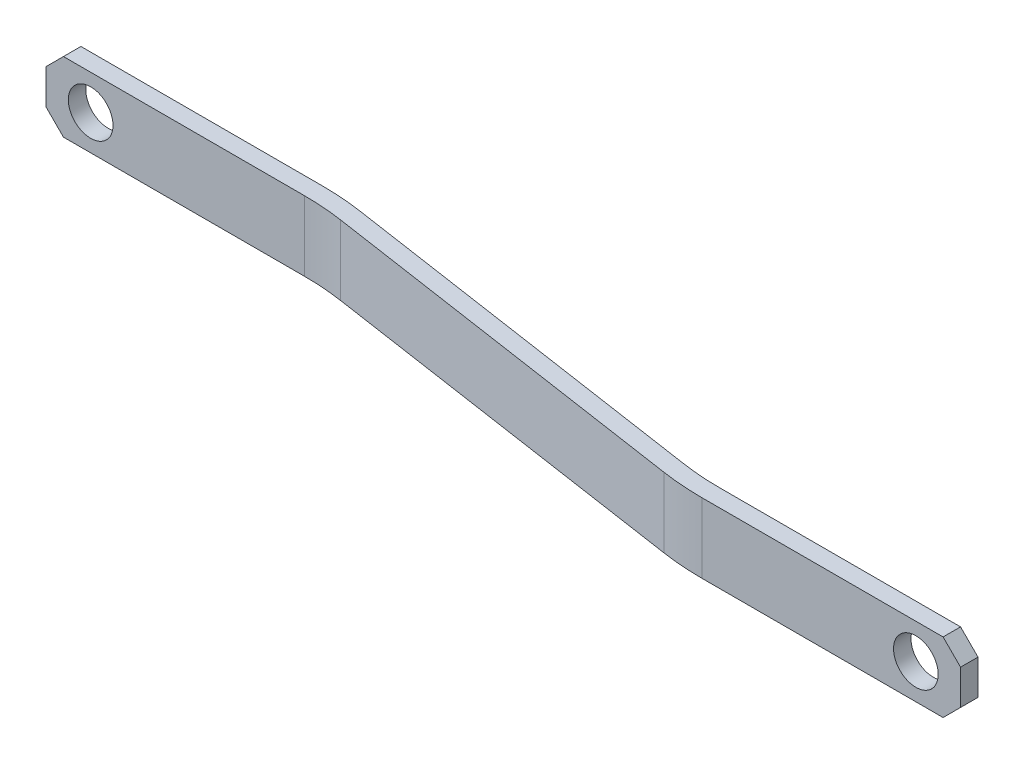
ISO-10303-21;
HEADER;
FILE_DESCRIPTION(('STEP AP214'),'2;1');
FILE_NAME('part.step','',(''),(''),'','','');
FILE_SCHEMA(('AUTOMOTIVE_DESIGN { 1 0 10303 214 1 1 1 1 }'));
ENDSEC;
DATA;
#1=APPLICATION_CONTEXT('core data for automotive mechanical design processes');
#2=APPLICATION_PROTOCOL_DEFINITION('international standard','automotive_design',2000,#1);
#3=PRODUCT_CONTEXT('',#1,'mechanical');
#4=PRODUCT('Part','Part','',(#3));
#5=PRODUCT_RELATED_PRODUCT_CATEGORY('part','',(#4));
#6=PRODUCT_DEFINITION_FORMATION('','',#4);
#7=PRODUCT_DEFINITION_CONTEXT('part definition',#1,'design');
#8=PRODUCT_DEFINITION('design','',#6,#7);
#9=PRODUCT_DEFINITION_SHAPE('','',#8);
#10=(LENGTH_UNIT() NAMED_UNIT(*) SI_UNIT(.MILLI.,.METRE.));
#11=(NAMED_UNIT(*) PLANE_ANGLE_UNIT() SI_UNIT($,.RADIAN.));
#12=(NAMED_UNIT(*) SI_UNIT($,.STERADIAN.) SOLID_ANGLE_UNIT());
#13=UNCERTAINTY_MEASURE_WITH_UNIT(LENGTH_MEASURE(1.E-05),#10,'distance_accuracy_value','');
#14=(GEOMETRIC_REPRESENTATION_CONTEXT(3) GLOBAL_UNCERTAINTY_ASSIGNED_CONTEXT((#13)) GLOBAL_UNIT_ASSIGNED_CONTEXT((#10,
#11,#12)) REPRESENTATION_CONTEXT('',''));
#15=CARTESIAN_POINT('',(0.,0.,0.));
#16=DIRECTION('',(0.,0.,1.));
#17=DIRECTION('',(1.,0.,0.));
#18=AXIS2_PLACEMENT_3D('',#15,#16,#17);
#19=CARTESIAN_POINT('',(47.0227665510806,-38.1,50.8));
#20=DIRECTION('',(0.,1.,0.));
#21=DIRECTION('',(-1.,0.,0.));
#22=AXIS2_PLACEMENT_3D('',#19,#20,#21);
#23=CYLINDRICAL_SURFACE('',#22,50.8);
#24=DIRECTION('',(0.,1.,0.));
#25=VECTOR('',#24,1.);
#26=CARTESIAN_POINT('',(54.5356969778409,-38.1,0.558623860381184));
#27=LINE('',#26,#25);
#28=CARTESIAN_POINT('',(54.5356969778409,0.,0.558623860381192));
#29=VERTEX_POINT('',#28);
#30=CARTESIAN_POINT('',(54.5356969778409,12.7,0.558623860381191));
#31=VERTEX_POINT('',#30);
#32=EDGE_CURVE('E271',#29,#31,#27,.T.);
#33=ORIENTED_EDGE('',*,*,#32,.F.);
#34=CARTESIAN_POINT('',(47.0227665510806,0.,50.8));
#35=DIRECTION('',(0.,1.,0.));
#36=DIRECTION('',(0.,0.,1.));
#37=AXIS2_PLACEMENT_3D('',#34,#35,#36);
#38=CIRCLE('',#37,50.8);
#39=CARTESIAN_POINT('',(47.0227665510806,0.,0.));
#40=VERTEX_POINT('',#39);
#41=EDGE_CURVE('E269',#29,#40,#38,.T.);
#42=ORIENTED_EDGE('',*,*,#41,.T.);
#43=DIRECTION('',(0.,1.,0.));
#44=VECTOR('',#43,1.);
#45=CARTESIAN_POINT('',(47.0227665510806,-38.1,0.));
#46=LINE('',#45,#44);
#47=CARTESIAN_POINT('',(47.0227665510806,12.7,0.));
#48=VERTEX_POINT('',#47);
#49=EDGE_CURVE('E190',#40,#48,#46,.T.);
#50=ORIENTED_EDGE('',*,*,#49,.T.);
#51=CARTESIAN_POINT('',(47.0227665510806,12.7,50.8));
#52=DIRECTION('',(0.,1.,0.));
#53=DIRECTION('',(1.,0.,0.));
#54=AXIS2_PLACEMENT_3D('',#51,#52,#53);
#55=CIRCLE('',#54,50.8);
#56=EDGE_CURVE('E236',#31,#48,#55,.T.);
#57=ORIENTED_EDGE('',*,*,#56,.F.);
#58=EDGE_LOOP('',(#33,#42,#50,#57));
#59=FACE_BOUND('',#58,.T.);
#60=ADVANCED_FACE('F47',(#59),#23,.T.);
#61=CARTESIAN_POINT('',(130.777233448919,-38.1,11.43));
#62=DIRECTION('',(0.,0.,-1.));
#63=DIRECTION('',(-1.,0.,0.));
#64=AXIS2_PLACEMENT_3D('',#61,#62,#63);
#65=PLANE('',#64);
#66=CARTESIAN_POINT('',(169.672,6.34999999999999,11.43));
#67=DIRECTION('',(0.,0.,1.));
#68=DIRECTION('',(1.,0.,0.));
#69=AXIS2_PLACEMENT_3D('',#66,#67,#68);
#70=CIRCLE('',#69,4.06399999999999);
#71=CARTESIAN_POINT('',(173.736,6.34999999999999,11.43));
#72=VERTEX_POINT('',#71);
#73=EDGE_CURVE('E307',#72,#72,#70,.T.);
#74=ORIENTED_EDGE('',*,*,#73,.T.);
#75=EDGE_LOOP('',(#74));
#76=FACE_BOUND('',#75,.T.);
#77=DIRECTION('',(-1.,0.,0.));
#78=VECTOR('',#77,1.);
#79=CARTESIAN_POINT('',(130.777233448919,12.7,11.43));
#80=LINE('',#79,#78);
#81=CARTESIAN_POINT('',(174.625,12.7,11.43));
#82=VERTEX_POINT('',#81);
#83=CARTESIAN_POINT('',(130.777233448919,12.7,11.43));
#84=VERTEX_POINT('',#83);
#85=EDGE_CURVE('E184',#82,#84,#80,.T.);
#86=ORIENTED_EDGE('',*,*,#85,.F.);
#87=DIRECTION('',(0.707106781186553,-0.707106781186542,0.));
#88=VECTOR('',#87,1.);
#89=CARTESIAN_POINT('',(178.101116724459,9.22388327554063,11.43));
#90=LINE('',#89,#88);
#91=CARTESIAN_POINT('',(177.8,9.52499999999996,11.43));
#92=VERTEX_POINT('',#91);
#93=EDGE_CURVE('E200',#82,#92,#90,.T.);
#94=ORIENTED_EDGE('',*,*,#93,.T.);
#95=DIRECTION('',(0.,1.,0.));
#96=VECTOR('',#95,1.);
#97=CARTESIAN_POINT('',(177.8,-38.1,11.43));
#98=LINE('',#97,#96);
#99=CARTESIAN_POINT('',(177.8,3.17500000000003,11.43));
#100=VERTEX_POINT('',#99);
#101=EDGE_CURVE('E279',#100,#92,#98,.T.);
#102=ORIENTED_EDGE('',*,*,#101,.F.);
#103=DIRECTION('',(-0.707106781186555,-0.70710678118654,0.));
#104=VECTOR('',#103,1.);
#105=CARTESIAN_POINT('',(133.651116724459,-40.9738832755398,11.43));
#106=LINE('',#105,#104);
#107=CARTESIAN_POINT('',(174.625,0.,11.43));
#108=VERTEX_POINT('',#107);
#109=EDGE_CURVE('E192',#100,#108,#106,.T.);
#110=ORIENTED_EDGE('',*,*,#109,.T.);
#111=DIRECTION('',(-1.,0.,0.));
#112=VECTOR('',#111,1.);
#113=CARTESIAN_POINT('',(0.,0.,11.43));
#114=LINE('',#113,#112);
#115=CARTESIAN_POINT('',(130.777233448919,0.,11.43));
#116=VERTEX_POINT('',#115);
#117=EDGE_CURVE('E258',#108,#116,#114,.T.);
#118=ORIENTED_EDGE('',*,*,#117,.T.);
#119=DIRECTION('',(0.,1.,0.));
#120=VECTOR('',#119,1.);
#121=CARTESIAN_POINT('',(130.777233448919,-38.1,11.43));
#122=LINE('',#121,#120);
#123=EDGE_CURVE('E282',#116,#84,#122,.T.);
#124=ORIENTED_EDGE('',*,*,#123,.T.);
#125=EDGE_LOOP('',(#86,#94,#102,#110,#118,#124));
#126=FACE_BOUND('',#125,.T.);
#127=ADVANCED_FACE('F331',(#76,#126),#65,.T.);
#128=CARTESIAN_POINT('',(130.777233448919,-38.1,-36.195));
#129=DIRECTION('',(0.,1.,0.));
#130=DIRECTION('',(-1.,0.,0.));
#131=AXIS2_PLACEMENT_3D('',#128,#129,#130);
#132=CYLINDRICAL_SURFACE('',#131,47.625);
#133=ORIENTED_EDGE('',*,*,#123,.F.);
#134=CARTESIAN_POINT('',(130.777233448919,0.,-36.195));
#135=DIRECTION('',(0.,1.,0.));
#136=DIRECTION('',(0.,0.,1.));
#137=AXIS2_PLACEMENT_3D('',#134,#135,#136);
#138=CIRCLE('',#137,47.625);
#139=CARTESIAN_POINT('',(123.733861173832,0.,10.9062901308926));
#140=VERTEX_POINT('',#139);
#141=EDGE_CURVE('E255',#116,#140,#138,.F.);
#142=ORIENTED_EDGE('',*,*,#141,.T.);
#143=DIRECTION('',(0.,1.,0.));
#144=VECTOR('',#143,1.);
#145=CARTESIAN_POINT('',(123.733861173832,-38.1,10.9062901308926));
#146=LINE('',#145,#144);
#147=CARTESIAN_POINT('',(123.733861173832,12.7,10.9062901308926));
#148=VERTEX_POINT('',#147);
#149=EDGE_CURVE('E285',#140,#148,#146,.T.);
#150=ORIENTED_EDGE('',*,*,#149,.T.);
#151=CARTESIAN_POINT('',(130.777233448919,12.7,-36.195));
#152=DIRECTION('',(0.,-1.,0.));
#153=DIRECTION('',(-1.,0.,0.));
#154=AXIS2_PLACEMENT_3D('',#151,#152,#153);
#155=CIRCLE('',#154,47.625);
#156=EDGE_CURVE('E293',#84,#148,#155,.T.);
#157=ORIENTED_EDGE('',*,*,#156,.F.);
#158=EDGE_LOOP('',(#133,#142,#150,#157));
#159=FACE_BOUND('',#158,.T.);
#160=ADVANCED_FACE('F337',(#159),#132,.F.);
#161=CARTESIAN_POINT('',(54.5356969778409,-38.1,0.558623860381191));
#162=DIRECTION('',(0.147892331235438,0.,-0.989003467315331));
#163=DIRECTION('',(-0.989003467315331,0.,-0.147892331235438));
#164=AXIS2_PLACEMENT_3D('',#161,#162,#163);
#165=PLANE('',#164);
#166=ORIENTED_EDGE('',*,*,#149,.F.);
#167=DIRECTION('',(-0.989003467315331,0.,-0.147892331235438));
#168=VECTOR('',#167,1.);
#169=CARTESIAN_POINT('',(3.24732013973059,0.,-7.11087161313806));
#170=LINE('',#169,#168);
#171=EDGE_CURVE('E247',#140,#29,#170,.T.);
#172=ORIENTED_EDGE('',*,*,#171,.T.);
#173=ORIENTED_EDGE('',*,*,#32,.T.);
#174=DIRECTION('',(-0.989003467315331,0.,-0.147892331235438));
#175=VECTOR('',#174,1.);
#176=CARTESIAN_POINT('',(54.5356969778409,12.7,0.558623860381191));
#177=LINE('',#176,#175);
#178=EDGE_CURVE('E291',#148,#31,#177,.T.);
#179=ORIENTED_EDGE('',*,*,#178,.F.);
#180=EDGE_LOOP('',(#166,#172,#173,#179));
#181=FACE_BOUND('',#180,.T.);
#182=ADVANCED_FACE('F345',(#181),#165,.T.);
#183=CARTESIAN_POINT('',(0.,0.,0.));
#184=DIRECTION('',(0.,0.,-1.));
#185=DIRECTION('',(-1.,0.,0.));
#186=AXIS2_PLACEMENT_3D('',#183,#184,#185);
#187=PLANE('',#186);
#188=CARTESIAN_POINT('',(8.128,6.35,0.));
#189=DIRECTION('',(0.,0.,1.));
#190=DIRECTION('',(1.,0.,0.));
#191=AXIS2_PLACEMENT_3D('',#188,#189,#190);
#192=CIRCLE('',#191,4.064);
#193=CARTESIAN_POINT('',(12.192,6.35,0.));
#194=VERTEX_POINT('',#193);
#195=EDGE_CURVE('E300',#194,#194,#192,.T.);
#196=ORIENTED_EDGE('',*,*,#195,.T.);
#197=EDGE_LOOP('',(#196));
#198=FACE_BOUND('',#197,.T.);
#199=DIRECTION('',(0.,1.,0.));
#200=VECTOR('',#199,1.);
#201=CARTESIAN_POINT('',(0.,0.,0.));
#202=LINE('',#201,#200);
#203=CARTESIAN_POINT('',(0.,3.17500000000002,0.));
#204=VERTEX_POINT('',#203);
#205=CARTESIAN_POINT('',(0.,9.52499999999998,0.));
#206=VERTEX_POINT('',#205);
#207=EDGE_CURVE('E244',#204,#206,#202,.T.);
#208=ORIENTED_EDGE('',*,*,#207,.T.);
#209=DIRECTION('',(0.707106781186556,0.707106781186539,0.));
#210=VECTOR('',#209,1.);
#211=CARTESIAN_POINT('',(-4.76249999999999,4.7625000000001,0.));
#212=LINE('',#211,#210);
#213=CARTESIAN_POINT('',(3.17500000000009,12.7,0.));
#214=VERTEX_POINT('',#213);
#215=EDGE_CURVE('E219',#206,#214,#212,.T.);
#216=ORIENTED_EDGE('',*,*,#215,.T.);
#217=DIRECTION('',(-1.,0.,0.));
#218=VECTOR('',#217,1.);
#219=CARTESIAN_POINT('',(177.8,12.7,0.));
#220=LINE('',#219,#218);
#221=EDGE_CURVE('E242',#48,#214,#220,.T.);
#222=ORIENTED_EDGE('',*,*,#221,.F.);
#223=ORIENTED_EDGE('',*,*,#49,.F.);
#224=DIRECTION('',(1.,0.,0.));
#225=VECTOR('',#224,1.);
#226=CARTESIAN_POINT('',(0.,0.,0.));
#227=LINE('',#226,#225);
#228=CARTESIAN_POINT('',(3.17500000000005,0.,0.));
#229=VERTEX_POINT('',#228);
#230=EDGE_CURVE('E174',#229,#40,#227,.T.);
#231=ORIENTED_EDGE('',*,*,#230,.F.);
#232=DIRECTION('',(-0.707106781186551,0.707106781186544,0.));
#233=VECTOR('',#232,1.);
#234=CARTESIAN_POINT('',(1.58750000000001,1.58750000000003,0.));
#235=LINE('',#234,#233);
#236=EDGE_CURVE('E217',#229,#204,#235,.T.);
#237=ORIENTED_EDGE('',*,*,#236,.T.);
#238=EDGE_LOOP('',(#208,#216,#222,#223,#231,#237));
#239=FACE_BOUND('',#238,.T.);
#240=ADVANCED_FACE('F240',(#198,#239),#187,.T.);
#241=CARTESIAN_POINT('',(0.,0.,14.605));
#242=DIRECTION('',(-1.,0.,0.));
#243=DIRECTION('',(0.,0.,1.));
#244=AXIS2_PLACEMENT_3D('',#241,#242,#243);
#245=PLANE('',#244);
#246=DIRECTION('',(0.,1.,0.));
#247=VECTOR('',#246,1.);
#248=CARTESIAN_POINT('',(0.,-38.1,3.175));
#249=LINE('',#248,#247);
#250=CARTESIAN_POINT('',(0.,3.17500000000003,3.175));
#251=VERTEX_POINT('',#250);
#252=CARTESIAN_POINT('',(0.,9.52499999999998,3.175));
#253=VERTEX_POINT('',#252);
#254=EDGE_CURVE('E225',#251,#253,#249,.T.);
#255=ORIENTED_EDGE('',*,*,#254,.T.);
#256=DIRECTION('',(0.,0.,-1.));
#257=VECTOR('',#256,1.);
#258=CARTESIAN_POINT('',(0.,9.52499999999998,0.));
#259=LINE('',#258,#257);
#260=EDGE_CURVE('E214',#253,#206,#259,.T.);
#261=ORIENTED_EDGE('',*,*,#260,.T.);
#262=ORIENTED_EDGE('',*,*,#207,.F.);
#263=DIRECTION('',(0.,0.,1.));
#264=VECTOR('',#263,1.);
#265=CARTESIAN_POINT('',(0.,3.17500000000002,3.175));
#266=LINE('',#265,#264);
#267=EDGE_CURVE('E212',#204,#251,#266,.T.);
#268=ORIENTED_EDGE('',*,*,#267,.T.);
#269=EDGE_LOOP('',(#255,#261,#262,#268));
#270=FACE_BOUND('',#269,.T.);
#271=ADVANCED_FACE('F231',(#270),#245,.T.);
#272=CARTESIAN_POINT('',(0.,0.,14.605));
#273=DIRECTION('',(0.,1.,0.));
#274=DIRECTION('',(0.,0.,1.));
#275=AXIS2_PLACEMENT_3D('',#272,#273,#274);
#276=PLANE('',#275);
#277=DIRECTION('',(1.,0.,0.));
#278=VECTOR('',#277,1.);
#279=CARTESIAN_POINT('',(0.,0.,3.175));
#280=LINE('',#279,#278);
#281=CARTESIAN_POINT('',(3.17500000000005,0.,3.175));
#282=VERTEX_POINT('',#281);
#283=CARTESIAN_POINT('',(47.0227665510805,0.,3.17499999999999));
#284=VERTEX_POINT('',#283);
#285=EDGE_CURVE('E266',#282,#284,#280,.T.);
#286=ORIENTED_EDGE('',*,*,#285,.F.);
#287=DIRECTION('',(0.,0.,-1.));
#288=VECTOR('',#287,1.);
#289=CARTESIAN_POINT('',(3.17500000000005,0.,0.));
#290=LINE('',#289,#288);
#291=EDGE_CURVE('E11',#282,#229,#290,.T.);
#292=ORIENTED_EDGE('',*,*,#291,.T.);
#293=ORIENTED_EDGE('',*,*,#230,.T.);
#294=ORIENTED_EDGE('',*,*,#41,.F.);
#295=ORIENTED_EDGE('',*,*,#171,.F.);
#296=ORIENTED_EDGE('',*,*,#141,.F.);
#297=ORIENTED_EDGE('',*,*,#117,.F.);
#298=DIRECTION('',(0.,0.,1.));
#299=VECTOR('',#298,1.);
#300=CARTESIAN_POINT('',(174.625,0.,14.605));
#301=LINE('',#300,#299);
#302=CARTESIAN_POINT('',(174.625,0.,14.605));
#303=VERTEX_POINT('',#302);
#304=EDGE_CURVE('E210',#108,#303,#301,.T.);
#305=ORIENTED_EDGE('',*,*,#304,.T.);
#306=DIRECTION('',(1.,0.,0.));
#307=VECTOR('',#306,1.);
#308=CARTESIAN_POINT('',(0.,0.,14.605));
#309=LINE('',#308,#307);
#310=CARTESIAN_POINT('',(130.777233448919,0.,14.605));
#311=VERTEX_POINT('',#310);
#312=EDGE_CURVE('E195',#311,#303,#309,.T.);
#313=ORIENTED_EDGE('',*,*,#312,.F.);
#314=CARTESIAN_POINT('',(130.777233448919,0.,-36.195));
#315=DIRECTION('',(0.,1.,0.));
#316=DIRECTION('',(0.,0.,1.));
#317=AXIS2_PLACEMENT_3D('',#314,#315,#316);
#318=CIRCLE('',#317,50.8);
#319=CARTESIAN_POINT('',(123.264303022159,0.,14.0463761396188));
#320=VERTEX_POINT('',#319);
#321=EDGE_CURVE('E188',#320,#311,#318,.T.);
#322=ORIENTED_EDGE('',*,*,#321,.F.);
#323=DIRECTION('',(0.989003467315331,0.,0.147892331235439));
#324=VECTOR('',#323,1.);
#325=CARTESIAN_POINT('',(2.77776198805809,0.,-3.97078560441192));
#326=LINE('',#325,#324);
#327=CARTESIAN_POINT('',(54.0661388261683,0.,3.69870986910734));
#328=VERTEX_POINT('',#327);
#329=EDGE_CURVE('E260',#328,#320,#326,.T.);
#330=ORIENTED_EDGE('',*,*,#329,.F.);
#331=CARTESIAN_POINT('',(47.0227665510805,0.,50.8));
#332=DIRECTION('',(0.,1.,0.));
#333=DIRECTION('',(0.,0.,1.));
#334=AXIS2_PLACEMENT_3D('',#331,#332,#333);
#335=CIRCLE('',#334,47.625);
#336=EDGE_CURVE('E263',#284,#328,#335,.F.);
#337=ORIENTED_EDGE('',*,*,#336,.F.);
#338=EDGE_LOOP('',(#286,#292,#293,#294,#295,#296,#297,#305,#313,#322,#330,#337));
#339=FACE_BOUND('',#338,.T.);
#340=ADVANCED_FACE('F374',(#339),#276,.F.);
#341=CARTESIAN_POINT('',(177.8,12.7,14.605));
#342=DIRECTION('',(1.,0.,0.));
#343=DIRECTION('',(0.,0.,-1.));
#344=AXIS2_PLACEMENT_3D('',#341,#342,#343);
#345=PLANE('',#344);
#346=ORIENTED_EDGE('',*,*,#101,.T.);
#347=DIRECTION('',(0.,0.,1.));
#348=VECTOR('',#347,1.);
#349=CARTESIAN_POINT('',(177.8,9.52499999999996,14.605));
#350=LINE('',#349,#348);
#351=CARTESIAN_POINT('',(177.8,9.52499999999996,14.605));
#352=VERTEX_POINT('',#351);
#353=EDGE_CURVE('E205',#92,#352,#350,.T.);
#354=ORIENTED_EDGE('',*,*,#353,.T.);
#355=DIRECTION('',(0.,-1.,0.));
#356=VECTOR('',#355,1.);
#357=CARTESIAN_POINT('',(177.8,12.7,14.605));
#358=LINE('',#357,#356);
#359=CARTESIAN_POINT('',(177.8,3.17500000000002,14.605));
#360=VERTEX_POINT('',#359);
#361=EDGE_CURVE('E173',#352,#360,#358,.T.);
#362=ORIENTED_EDGE('',*,*,#361,.T.);
#363=DIRECTION('',(0.,0.,-1.));
#364=VECTOR('',#363,1.);
#365=CARTESIAN_POINT('',(177.8,3.17500000000002,11.43));
#366=LINE('',#365,#364);
#367=EDGE_CURVE('E202',#360,#100,#366,.T.);
#368=ORIENTED_EDGE('',*,*,#367,.T.);
#369=EDGE_LOOP('',(#346,#354,#362,#368));
#370=FACE_BOUND('',#369,.T.);
#371=ADVANCED_FACE('F326',(#370),#345,.T.);
#372=CARTESIAN_POINT('',(177.8,12.7,14.605));
#373=DIRECTION('',(0.,-1.,0.));
#374=DIRECTION('',(1.,0.,0.));
#375=AXIS2_PLACEMENT_3D('',#372,#373,#374);
#376=PLANE('',#375);
#377=ORIENTED_EDGE('',*,*,#221,.T.);
#378=DIRECTION('',(0.,0.,1.));
#379=VECTOR('',#378,1.);
#380=CARTESIAN_POINT('',(3.17500000000009,12.7,3.175));
#381=LINE('',#380,#379);
#382=CARTESIAN_POINT('',(3.17500000000009,12.7,3.175));
#383=VERTEX_POINT('',#382);
#384=EDGE_CURVE('E70',#214,#383,#381,.T.);
#385=ORIENTED_EDGE('',*,*,#384,.T.);
#386=DIRECTION('',(1.,0.,0.));
#387=VECTOR('',#386,1.);
#388=CARTESIAN_POINT('',(0.,12.7,3.175));
#389=LINE('',#388,#387);
#390=CARTESIAN_POINT('',(47.0227665510805,12.7,3.17499999999999));
#391=VERTEX_POINT('',#390);
#392=EDGE_CURVE('E227',#383,#391,#389,.T.);
#393=ORIENTED_EDGE('',*,*,#392,.T.);
#394=CARTESIAN_POINT('',(47.0227665510805,12.7,50.8));
#395=DIRECTION('',(0.,-1.,0.));
#396=DIRECTION('',(1.,0.,0.));
#397=AXIS2_PLACEMENT_3D('',#394,#395,#396);
#398=CIRCLE('',#397,47.625);
#399=CARTESIAN_POINT('',(54.0661388261683,12.7,3.69870986910734));
#400=VERTEX_POINT('',#399);
#401=EDGE_CURVE('E297',#391,#400,#398,.T.);
#402=ORIENTED_EDGE('',*,*,#401,.T.);
#403=DIRECTION('',(0.989003467315331,0.,0.147892331235439));
#404=VECTOR('',#403,1.);
#405=CARTESIAN_POINT('',(54.0661388261683,12.7,3.69870986910734));
#406=LINE('',#405,#404);
#407=CARTESIAN_POINT('',(123.264303022159,12.7,14.0463761396188));
#408=VERTEX_POINT('',#407);
#409=EDGE_CURVE('E180',#400,#408,#406,.T.);
#410=ORIENTED_EDGE('',*,*,#409,.T.);
#411=CARTESIAN_POINT('',(130.777233448919,12.7,-36.195));
#412=DIRECTION('',(0.,1.,0.));
#413=DIRECTION('',(-1.,0.,0.));
#414=AXIS2_PLACEMENT_3D('',#411,#412,#413);
#415=CIRCLE('',#414,50.8);
#416=CARTESIAN_POINT('',(130.777233448919,12.7,14.605));
#417=VERTEX_POINT('',#416);
#418=EDGE_CURVE('E177',#408,#417,#415,.T.);
#419=ORIENTED_EDGE('',*,*,#418,.T.);
#420=DIRECTION('',(-1.,0.,0.));
#421=VECTOR('',#420,1.);
#422=CARTESIAN_POINT('',(177.8,12.7,14.605));
#423=LINE('',#422,#421);
#424=CARTESIAN_POINT('',(174.625,12.7,14.605));
#425=VERTEX_POINT('',#424);
#426=EDGE_CURVE('E161',#425,#417,#423,.T.);
#427=ORIENTED_EDGE('',*,*,#426,.F.);
#428=DIRECTION('',(0.,0.,-1.));
#429=VECTOR('',#428,1.);
#430=CARTESIAN_POINT('',(174.625,12.7,11.43));
#431=LINE('',#430,#429);
#432=EDGE_CURVE('E189',#425,#82,#431,.T.);
#433=ORIENTED_EDGE('',*,*,#432,.T.);
#434=ORIENTED_EDGE('',*,*,#85,.T.);
#435=ORIENTED_EDGE('',*,*,#156,.T.);
#436=ORIENTED_EDGE('',*,*,#178,.T.);
#437=ORIENTED_EDGE('',*,*,#56,.T.);
#438=EDGE_LOOP('',(#377,#385,#393,#402,#410,#419,#427,#433,#434,#435,#436,#437));
#439=FACE_BOUND('',#438,.T.);
#440=ADVANCED_FACE('F178',(#439),#376,.F.);
#441=CARTESIAN_POINT('',(0.,0.,14.605));
#442=DIRECTION('',(0.,0.,-1.));
#443=DIRECTION('',(-1.,0.,0.));
#444=AXIS2_PLACEMENT_3D('',#441,#442,#443);
#445=PLANE('',#444);
#446=CARTESIAN_POINT('',(169.672,6.34999999999999,14.605));
#447=DIRECTION('',(0.,0.,1.));
#448=DIRECTION('',(1.,0.,0.));
#449=AXIS2_PLACEMENT_3D('',#446,#447,#448);
#450=CIRCLE('',#449,4.06399999999999);
#451=CARTESIAN_POINT('',(173.736,6.34999999999999,14.605));
#452=VERTEX_POINT('',#451);
#453=EDGE_CURVE('E304',#452,#452,#450,.T.);
#454=ORIENTED_EDGE('',*,*,#453,.F.);
#455=EDGE_LOOP('',(#454));
#456=FACE_BOUND('',#455,.T.);
#457=ORIENTED_EDGE('',*,*,#361,.F.);
#458=DIRECTION('',(-0.707106781186553,0.707106781186542,0.));
#459=VECTOR('',#458,1.);
#460=CARTESIAN_POINT('',(174.625,12.7,14.605));
#461=LINE('',#460,#459);
#462=EDGE_CURVE('E170',#352,#425,#461,.T.);
#463=ORIENTED_EDGE('',*,*,#462,.T.);
#464=ORIENTED_EDGE('',*,*,#426,.T.);
#465=DIRECTION('',(0.,1.,0.));
#466=VECTOR('',#465,1.);
#467=CARTESIAN_POINT('',(130.777233448919,-38.1,14.605));
#468=LINE('',#467,#466);
#469=EDGE_CURVE('E167',#311,#417,#468,.T.);
#470=ORIENTED_EDGE('',*,*,#469,.F.);
#471=ORIENTED_EDGE('',*,*,#312,.T.);
#472=DIRECTION('',(0.707106781186555,0.70710678118654,0.));
#473=VECTOR('',#472,1.);
#474=CARTESIAN_POINT('',(177.8,3.17500000000002,14.605));
#475=LINE('',#474,#473);
#476=EDGE_CURVE('E207',#303,#360,#475,.T.);
#477=ORIENTED_EDGE('',*,*,#476,.T.);
#478=EDGE_LOOP('',(#457,#463,#464,#470,#471,#477));
#479=FACE_BOUND('',#478,.T.);
#480=ADVANCED_FACE('F164',(#456,#479),#445,.F.);
#481=CARTESIAN_POINT('',(54.0661388261683,-38.1,3.69870986910734));
#482=DIRECTION('',(-0.147892331235439,0.,0.989003467315331));
#483=DIRECTION('',(0.989003467315331,0.,0.147892331235439));
#484=AXIS2_PLACEMENT_3D('',#481,#482,#483);
#485=PLANE('',#484);
#486=DIRECTION('',(0.,1.,0.));
#487=VECTOR('',#486,1.);
#488=CARTESIAN_POINT('',(54.0661388261683,-38.1,3.69870986910734));
#489=LINE('',#488,#487);
#490=EDGE_CURVE('E274',#328,#400,#489,.T.);
#491=ORIENTED_EDGE('',*,*,#490,.F.);
#492=ORIENTED_EDGE('',*,*,#329,.T.);
#493=DIRECTION('',(0.,1.,0.));
#494=VECTOR('',#493,1.);
#495=CARTESIAN_POINT('',(123.264303022159,-38.1,14.0463761396188));
#496=LINE('',#495,#494);
#497=EDGE_CURVE('E277',#320,#408,#496,.T.);
#498=ORIENTED_EDGE('',*,*,#497,.T.);
#499=ORIENTED_EDGE('',*,*,#409,.F.);
#500=EDGE_LOOP('',(#491,#492,#498,#499));
#501=FACE_BOUND('',#500,.T.);
#502=ADVANCED_FACE('F317',(#501),#485,.T.);
#503=CARTESIAN_POINT('',(47.0227665510805,-38.1,50.8));
#504=DIRECTION('',(0.,1.,0.));
#505=DIRECTION('',(-1.,0.,0.));
#506=AXIS2_PLACEMENT_3D('',#503,#504,#505);
#507=CYLINDRICAL_SURFACE('',#506,47.625);
#508=DIRECTION('',(0.,1.,0.));
#509=VECTOR('',#508,1.);
#510=CARTESIAN_POINT('',(47.0227665510805,-38.1,3.17499999999999));
#511=LINE('',#510,#509);
#512=EDGE_CURVE('E235',#284,#391,#511,.T.);
#513=ORIENTED_EDGE('',*,*,#512,.F.);
#514=ORIENTED_EDGE('',*,*,#336,.T.);
#515=ORIENTED_EDGE('',*,*,#490,.T.);
#516=ORIENTED_EDGE('',*,*,#401,.F.);
#517=EDGE_LOOP('',(#513,#514,#515,#516));
#518=FACE_BOUND('',#517,.T.);
#519=ADVANCED_FACE('F323',(#518),#507,.F.);
#520=CARTESIAN_POINT('',(0.,-38.1,3.175));
#521=DIRECTION('',(0.,0.,1.));
#522=DIRECTION('',(1.,0.,0.));
#523=AXIS2_PLACEMENT_3D('',#520,#521,#522);
#524=PLANE('',#523);
#525=CARTESIAN_POINT('',(8.128,6.35,3.175));
#526=DIRECTION('',(0.,0.,1.));
#527=DIRECTION('',(1.,0.,0.));
#528=AXIS2_PLACEMENT_3D('',#525,#526,#527);
#529=CIRCLE('',#528,4.064);
#530=CARTESIAN_POINT('',(12.192,6.35,3.175));
#531=VERTEX_POINT('',#530);
#532=EDGE_CURVE('E301',#531,#531,#529,.T.);
#533=ORIENTED_EDGE('',*,*,#532,.F.);
#534=EDGE_LOOP('',(#533));
#535=FACE_BOUND('',#534,.T.);
#536=ORIENTED_EDGE('',*,*,#392,.F.);
#537=DIRECTION('',(-0.707106781186556,-0.707106781186539,0.));
#538=VECTOR('',#537,1.);
#539=CARTESIAN_POINT('',(-23.8125,-14.2874999999995,3.175));
#540=LINE('',#539,#538);
#541=EDGE_CURVE('E55',#383,#253,#540,.T.);
#542=ORIENTED_EDGE('',*,*,#541,.T.);
#543=ORIENTED_EDGE('',*,*,#254,.F.);
#544=DIRECTION('',(0.707106781186551,-0.707106781186544,0.));
#545=VECTOR('',#544,1.);
#546=CARTESIAN_POINT('',(20.6375,-17.4624999999998,3.175));
#547=LINE('',#546,#545);
#548=EDGE_CURVE('E62',#251,#282,#547,.T.);
#549=ORIENTED_EDGE('',*,*,#548,.T.);
#550=ORIENTED_EDGE('',*,*,#285,.T.);
#551=ORIENTED_EDGE('',*,*,#512,.T.);
#552=EDGE_LOOP('',(#536,#542,#543,#549,#550,#551));
#553=FACE_BOUND('',#552,.T.);
#554=ADVANCED_FACE('F224',(#535,#553),#524,.T.);
#555=CARTESIAN_POINT('',(130.777233448919,-38.1,-36.195));
#556=DIRECTION('',(0.,1.,0.));
#557=DIRECTION('',(-1.,0.,0.));
#558=AXIS2_PLACEMENT_3D('',#555,#556,#557);
#559=CYLINDRICAL_SURFACE('',#558,50.8);
#560=ORIENTED_EDGE('',*,*,#497,.F.);
#561=ORIENTED_EDGE('',*,*,#321,.T.);
#562=ORIENTED_EDGE('',*,*,#469,.T.);
#563=ORIENTED_EDGE('',*,*,#418,.F.);
#564=EDGE_LOOP('',(#560,#561,#562,#563));
#565=FACE_BOUND('',#564,.T.);
#566=ADVANCED_FACE('F187',(#565),#559,.T.);
#567=CARTESIAN_POINT('',(8.128,6.35,0.));
#568=DIRECTION('',(0.,0.,1.));
#569=DIRECTION('',(1.,0.,0.));
#570=AXIS2_PLACEMENT_3D('',#567,#568,#569);
#571=CYLINDRICAL_SURFACE('',#570,4.064);
#572=ORIENTED_EDGE('',*,*,#195,.F.);
#573=EDGE_LOOP('',(#572));
#574=FACE_BOUND('',#573,.T.);
#575=ORIENTED_EDGE('',*,*,#532,.T.);
#576=EDGE_LOOP('',(#575));
#577=FACE_BOUND('',#576,.T.);
#578=ADVANCED_FACE('F343',(#574,#577),#571,.F.);
#579=CARTESIAN_POINT('',(169.672,6.34999999999999,14.605));
#580=DIRECTION('',(0.,0.,-1.));
#581=DIRECTION('',(-1.,0.,0.));
#582=AXIS2_PLACEMENT_3D('',#579,#580,#581);
#583=CYLINDRICAL_SURFACE('',#582,4.06399999999999);
#584=ORIENTED_EDGE('',*,*,#453,.T.);
#585=EDGE_LOOP('',(#584));
#586=FACE_BOUND('',#585,.T.);
#587=ORIENTED_EDGE('',*,*,#73,.F.);
#588=EDGE_LOOP('',(#587));
#589=FACE_BOUND('',#588,.T.);
#590=ADVANCED_FACE('F313',(#586,#589),#583,.F.);
#591=CARTESIAN_POINT('',(174.625,12.7,14.605));
#592=DIRECTION('',(0.707106781186542,0.707106781186553,0.));
#593=DIRECTION('',(-0.707106781186553,0.707106781186542,0.));
#594=AXIS2_PLACEMENT_3D('',#591,#592,#593);
#595=PLANE('',#594);
#596=ORIENTED_EDGE('',*,*,#462,.F.);
#597=ORIENTED_EDGE('',*,*,#353,.F.);
#598=ORIENTED_EDGE('',*,*,#93,.F.);
#599=ORIENTED_EDGE('',*,*,#432,.F.);
#600=EDGE_LOOP('',(#596,#597,#598,#599));
#601=FACE_BOUND('',#600,.T.);
#602=ADVANCED_FACE('F367',(#601),#595,.T.);
#603=CARTESIAN_POINT('',(177.8,3.17500000000002,14.605));
#604=DIRECTION('',(0.70710678118654,-0.707106781186555,0.));
#605=DIRECTION('',(0.707106781186555,0.70710678118654,0.));
#606=AXIS2_PLACEMENT_3D('',#603,#604,#605);
#607=PLANE('',#606);
#608=ORIENTED_EDGE('',*,*,#476,.F.);
#609=ORIENTED_EDGE('',*,*,#304,.F.);
#610=ORIENTED_EDGE('',*,*,#109,.F.);
#611=ORIENTED_EDGE('',*,*,#367,.F.);
#612=EDGE_LOOP('',(#608,#609,#610,#611));
#613=FACE_BOUND('',#612,.T.);
#614=ADVANCED_FACE('F385',(#613),#607,.T.);
#615=CARTESIAN_POINT('',(0.,9.52499999999998,14.605));
#616=DIRECTION('',(-0.707106781186539,0.707106781186556,0.));
#617=DIRECTION('',(-0.707106781186556,-0.707106781186539,0.));
#618=AXIS2_PLACEMENT_3D('',#615,#616,#617);
#619=PLANE('',#618);
#620=ORIENTED_EDGE('',*,*,#541,.F.);
#621=ORIENTED_EDGE('',*,*,#384,.F.);
#622=ORIENTED_EDGE('',*,*,#215,.F.);
#623=ORIENTED_EDGE('',*,*,#260,.F.);
#624=EDGE_LOOP('',(#620,#621,#622,#623));
#625=FACE_BOUND('',#624,.T.);
#626=ADVANCED_FACE('F238',(#625),#619,.T.);
#627=CARTESIAN_POINT('',(3.17500000000005,0.,14.605));
#628=DIRECTION('',(-0.707106781186544,-0.707106781186551,0.));
#629=DIRECTION('',(0.707106781186551,-0.707106781186544,0.));
#630=AXIS2_PLACEMENT_3D('',#627,#628,#629);
#631=PLANE('',#630);
#632=ORIENTED_EDGE('',*,*,#548,.F.);
#633=ORIENTED_EDGE('',*,*,#267,.F.);
#634=ORIENTED_EDGE('',*,*,#236,.F.);
#635=ORIENTED_EDGE('',*,*,#291,.F.);
#636=EDGE_LOOP('',(#632,#633,#634,#635));
#637=FACE_BOUND('',#636,.T.);
#638=ADVANCED_FACE('F49',(#637),#631,.T.);
#639=CLOSED_SHELL('',(#60,#127,#160,#182,#240,#271,#340,#371,#440,#480,#502,#519,#554,#566,#578,
#590,#602,#614,#626,#638));
#640=MANIFOLD_SOLID_BREP('B2',#639);
#641=ADVANCED_BREP_SHAPE_REPRESENTATION('',(#18,#640),#14);
#642=SHAPE_DEFINITION_REPRESENTATION(#9,#641);
ENDSEC;
END-ISO-10303-21;
